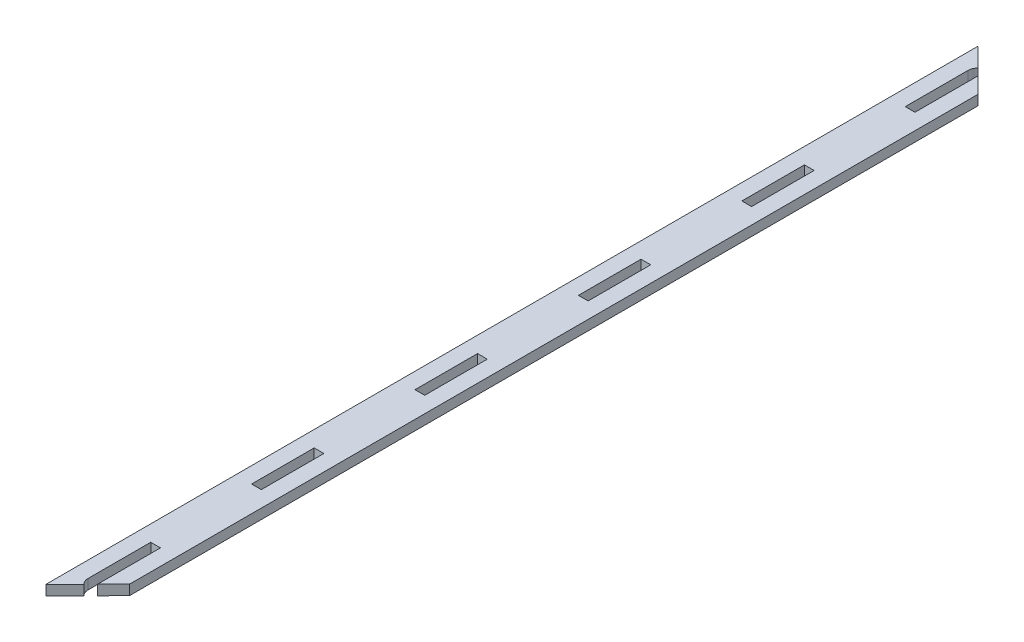
ISO-10303-21;
HEADER;
FILE_DESCRIPTION(('STEP AP214'),'2;1');
FILE_NAME('part.step','',(''),(''),'','','');
FILE_SCHEMA(('AUTOMOTIVE_DESIGN { 1 0 10303 214 1 1 1 1 }'));
ENDSEC;
DATA;
#1=APPLICATION_CONTEXT('core data for automotive mechanical design processes');
#2=APPLICATION_PROTOCOL_DEFINITION('international standard','automotive_design',2000,#1);
#3=PRODUCT_CONTEXT('',#1,'mechanical');
#4=PRODUCT('Part','Part','',(#3));
#5=PRODUCT_RELATED_PRODUCT_CATEGORY('part','',(#4));
#6=PRODUCT_DEFINITION_FORMATION('','',#4);
#7=PRODUCT_DEFINITION_CONTEXT('part definition',#1,'design');
#8=PRODUCT_DEFINITION('design','',#6,#7);
#9=PRODUCT_DEFINITION_SHAPE('','',#8);
#10=(LENGTH_UNIT() NAMED_UNIT(*) SI_UNIT(.MILLI.,.METRE.));
#11=(NAMED_UNIT(*) PLANE_ANGLE_UNIT() SI_UNIT($,.RADIAN.));
#12=(NAMED_UNIT(*) SI_UNIT($,.STERADIAN.) SOLID_ANGLE_UNIT());
#13=UNCERTAINTY_MEASURE_WITH_UNIT(LENGTH_MEASURE(1.E-05),#10,'distance_accuracy_value','');
#14=(GEOMETRIC_REPRESENTATION_CONTEXT(3) GLOBAL_UNCERTAINTY_ASSIGNED_CONTEXT((#13)) GLOBAL_UNIT_ASSIGNED_CONTEXT((#10,
#11,#12)) REPRESENTATION_CONTEXT('',''));
#15=CARTESIAN_POINT('',(0.,0.,0.));
#16=DIRECTION('',(0.,0.,1.));
#17=DIRECTION('',(1.,0.,0.));
#18=AXIS2_PLACEMENT_3D('',#15,#16,#17);
#19=CARTESIAN_POINT('',(5.04063999999979,-296.892534240329,-60.2456400000004));
#20=DIRECTION('',(0.,0.,1.));
#21=DIRECTION('',(1.,0.,0.));
#22=AXIS2_PLACEMENT_3D('',#19,#20,#21);
#23=PLANE('',#22);
#24=DIRECTION('',(0.,1.,0.));
#25=VECTOR('',#24,1.);
#26=CARTESIAN_POINT('',(8.13435999999979,-296.892534240329,-60.2456400000004));
#27=LINE('',#26,#25);
#28=CARTESIAN_POINT('',(8.13435999999979,0.,-60.2456400000004));
#29=VERTEX_POINT('',#28);
#30=CARTESIAN_POINT('',(8.13435999999979,3.175,-60.2456400000004));
#31=VERTEX_POINT('',#30);
#32=EDGE_CURVE('E112',#29,#31,#27,.T.);
#33=ORIENTED_EDGE('',*,*,#32,.F.);
#34=DIRECTION('',(-1.,0.,0.));
#35=VECTOR('',#34,1.);
#36=CARTESIAN_POINT('',(5.04063999999979,0.,-60.2456400000004));
#37=LINE('',#36,#35);
#38=CARTESIAN_POINT('',(5.04063999999979,0.,-60.2456400000004));
#39=VERTEX_POINT('',#38);
#40=EDGE_CURVE('E45',#29,#39,#37,.T.);
#41=ORIENTED_EDGE('',*,*,#40,.T.);
#42=DIRECTION('',(0.,1.,0.));
#43=VECTOR('',#42,1.);
#44=CARTESIAN_POINT('',(5.04063999999979,-296.892534240329,-60.2456400000004));
#45=LINE('',#44,#43);
#46=CARTESIAN_POINT('',(5.04063999999979,3.175,-60.2456400000004));
#47=VERTEX_POINT('',#46);
#48=EDGE_CURVE('E125',#39,#47,#45,.T.);
#49=ORIENTED_EDGE('',*,*,#48,.T.);
#50=DIRECTION('',(1.,0.,0.));
#51=VECTOR('',#50,1.);
#52=CARTESIAN_POINT('',(5.04063999999979,3.175,-60.2456400000004));
#53=LINE('',#52,#51);
#54=EDGE_CURVE('E122',#47,#31,#53,.T.);
#55=ORIENTED_EDGE('',*,*,#54,.T.);
#56=EDGE_LOOP('',(#33,#41,#49,#55));
#57=FACE_BOUND('',#56,.T.);
#58=ADVANCED_FACE('F41',(#57),#23,.F.);
#59=CARTESIAN_POINT('',(8.13435999999979,-296.892534240329,-60.2456400000004));
#60=DIRECTION('',(1.,0.,0.));
#61=DIRECTION('',(0.,0.,-1.));
#62=AXIS2_PLACEMENT_3D('',#59,#60,#61);
#63=PLANE('',#62);
#64=DIRECTION('',(0.,1.,0.));
#65=VECTOR('',#64,1.);
#66=CARTESIAN_POINT('',(8.13435999999973,-296.892534240329,-80.1643600000004));
#67=LINE('',#66,#65);
#68=CARTESIAN_POINT('',(8.13435999999973,0.,-80.1643600000004));
#69=VERTEX_POINT('',#68);
#70=CARTESIAN_POINT('',(8.13435999999973,3.175,-80.1643600000004));
#71=VERTEX_POINT('',#70);
#72=EDGE_CURVE('E115',#69,#71,#67,.T.);
#73=ORIENTED_EDGE('',*,*,#72,.F.);
#74=DIRECTION('',(0.,0.,1.));
#75=VECTOR('',#74,1.);
#76=CARTESIAN_POINT('',(8.13435999999979,0.,-60.2456400000004));
#77=LINE('',#76,#75);
#78=EDGE_CURVE('E93',#69,#29,#77,.T.);
#79=ORIENTED_EDGE('',*,*,#78,.T.);
#80=ORIENTED_EDGE('',*,*,#32,.T.);
#81=DIRECTION('',(0.,0.,-1.));
#82=VECTOR('',#81,1.);
#83=CARTESIAN_POINT('',(8.13435999999979,3.175,-60.2456400000004));
#84=LINE('',#83,#82);
#85=EDGE_CURVE('E503',#31,#71,#84,.T.);
#86=ORIENTED_EDGE('',*,*,#85,.T.);
#87=EDGE_LOOP('',(#73,#79,#80,#86));
#88=FACE_BOUND('',#87,.T.);
#89=ADVANCED_FACE('F109',(#88),#63,.F.);
#90=CARTESIAN_POINT('',(8.13435999999973,-296.892534240329,-80.1643600000004));
#91=DIRECTION('',(0.,0.,-1.));
#92=DIRECTION('',(-1.,0.,0.));
#93=AXIS2_PLACEMENT_3D('',#90,#91,#92);
#94=PLANE('',#93);
#95=DIRECTION('',(0.,1.,0.));
#96=VECTOR('',#95,1.);
#97=CARTESIAN_POINT('',(5.04063999999973,-296.892534240329,-80.1643600000004));
#98=LINE('',#97,#96);
#99=CARTESIAN_POINT('',(5.04063999999973,0.,-80.1643600000004));
#100=VERTEX_POINT('',#99);
#101=CARTESIAN_POINT('',(5.04063999999973,3.175,-80.1643600000004));
#102=VERTEX_POINT('',#101);
#103=EDGE_CURVE('E129',#100,#102,#98,.T.);
#104=ORIENTED_EDGE('',*,*,#103,.F.);
#105=DIRECTION('',(1.,0.,0.));
#106=VECTOR('',#105,1.);
#107=CARTESIAN_POINT('',(8.13435999999973,0.,-80.1643600000004));
#108=LINE('',#107,#106);
#109=EDGE_CURVE('E119',#100,#69,#108,.T.);
#110=ORIENTED_EDGE('',*,*,#109,.T.);
#111=ORIENTED_EDGE('',*,*,#72,.T.);
#112=DIRECTION('',(-1.,0.,0.));
#113=VECTOR('',#112,1.);
#114=CARTESIAN_POINT('',(8.13435999999973,3.175,-80.1643600000004));
#115=LINE('',#114,#113);
#116=EDGE_CURVE('E131',#71,#102,#115,.T.);
#117=ORIENTED_EDGE('',*,*,#116,.T.);
#118=EDGE_LOOP('',(#104,#110,#111,#117));
#119=FACE_BOUND('',#118,.T.);
#120=ADVANCED_FACE('F520',(#119),#94,.F.);
#121=CARTESIAN_POINT('',(5.04063999999973,-296.892534240329,-80.1643600000004));
#122=DIRECTION('',(-1.,0.,0.));
#123=DIRECTION('',(0.,0.,1.));
#124=AXIS2_PLACEMENT_3D('',#121,#122,#123);
#125=PLANE('',#124);
#126=ORIENTED_EDGE('',*,*,#48,.F.);
#127=DIRECTION('',(0.,0.,-1.));
#128=VECTOR('',#127,1.);
#129=CARTESIAN_POINT('',(5.04063999999973,0.,-80.1643600000004));
#130=LINE('',#129,#128);
#131=EDGE_CURVE('E99',#39,#100,#130,.T.);
#132=ORIENTED_EDGE('',*,*,#131,.T.);
#133=ORIENTED_EDGE('',*,*,#103,.T.);
#134=DIRECTION('',(0.,0.,1.));
#135=VECTOR('',#134,1.);
#136=CARTESIAN_POINT('',(5.04063999999973,3.175,-80.1643600000004));
#137=LINE('',#136,#135);
#138=EDGE_CURVE('E497',#102,#47,#137,.T.);
#139=ORIENTED_EDGE('',*,*,#138,.T.);
#140=EDGE_LOOP('',(#126,#132,#133,#139));
#141=FACE_BOUND('',#140,.T.);
#142=ADVANCED_FACE('F513',(#141),#125,.F.);
#143=CARTESIAN_POINT('',(0.,0.,0.));
#144=DIRECTION('',(0.,1.,0.));
#145=DIRECTION('',(0.,0.,1.));
#146=AXIS2_PLACEMENT_3D('',#143,#144,#145);
#147=PLANE('',#146);
#148=DIRECTION('',(0.707106781186543,0.,0.707106781186552));
#149=VECTOR('',#148,1.);
#150=CARTESIAN_POINT('',(5.98759591702659,0.,-290.469877722147));
#151=LINE('',#150,#149);
#152=CARTESIAN_POINT('',(-0.04064,0.,-296.498113639174));
#153=VERTEX_POINT('',#152);
#154=CARTESIAN_POINT('',(5.98759591702655,0.,-290.469877722147));
#155=VERTEX_POINT('',#154);
#156=EDGE_CURVE('E351',#153,#155,#151,.T.);
#157=ORIENTED_EDGE('',*,*,#156,.T.);
#158=CARTESIAN_POINT('',(8.175,0.,-288.224999999999));
#159=DIRECTION('',(0.,1.,0.));
#160=DIRECTION('',(0.,0.,1.));
#161=AXIS2_PLACEMENT_3D('',#158,#159,#160);
#162=CIRCLE('',#161,3.13436000000096);
#163=CARTESIAN_POINT('',(5.04063999999901,0.,-288.225));
#164=VERTEX_POINT('',#163);
#165=EDGE_CURVE('E492',#155,#164,#162,.T.);
#166=ORIENTED_EDGE('',*,*,#165,.T.);
#167=DIRECTION('',(0.,0.,1.));
#168=VECTOR('',#167,1.);
#169=CARTESIAN_POINT('',(5.04063999999908,0.,-268.26564));
#170=LINE('',#169,#168);
#171=CARTESIAN_POINT('',(5.04063999999908,0.,-268.26564));
#172=VERTEX_POINT('',#171);
#173=EDGE_CURVE('E489',#164,#172,#170,.T.);
#174=ORIENTED_EDGE('',*,*,#173,.T.);
#175=DIRECTION('',(1.,0.,0.));
#176=VECTOR('',#175,1.);
#177=CARTESIAN_POINT('',(8.13435999999908,0.,-268.26564));
#178=LINE('',#177,#176);
#179=CARTESIAN_POINT('',(8.13435999999908,0.,-268.26564));
#180=VERTEX_POINT('',#179);
#181=EDGE_CURVE('E486',#172,#180,#178,.T.);
#182=ORIENTED_EDGE('',*,*,#181,.T.);
#183=DIRECTION('',(0.,0.,-1.));
#184=VECTOR('',#183,1.);
#185=CARTESIAN_POINT('',(8.13436000000001,0.,-288.323113639174));
#186=LINE('',#185,#184);
#187=CARTESIAN_POINT('',(8.13436000000003,0.,-288.323113639174));
#188=VERTEX_POINT('',#187);
#189=EDGE_CURVE('E483',#180,#188,#186,.T.);
#190=ORIENTED_EDGE('',*,*,#189,.T.);
#191=DIRECTION('',(0.707106781186534,0.,0.707106781186562));
#192=VECTOR('',#191,1.);
#193=CARTESIAN_POINT('',(13.215639999999,0.,-283.241833639175));
#194=LINE('',#193,#192);
#195=CARTESIAN_POINT('',(13.215639999999,0.,-283.241833639175));
#196=VERTEX_POINT('',#195);
#197=EDGE_CURVE('E480',#188,#196,#194,.T.);
#198=ORIENTED_EDGE('',*,*,#197,.T.);
#199=DIRECTION('',(0.,0.,1.));
#200=VECTOR('',#199,1.);
#201=CARTESIAN_POINT('',(13.21564,0.,-13.1984932147829));
#202=LINE('',#201,#200);
#203=CARTESIAN_POINT('',(13.21564,0.,-13.1984932147829));
#204=VERTEX_POINT('',#203);
#205=EDGE_CURVE('E477',#196,#204,#202,.T.);
#206=ORIENTED_EDGE('',*,*,#205,.T.);
#207=DIRECTION('',(-0.706026406022671,0.,0.708185508181797));
#208=VECTOR('',#207,1.);
#209=CARTESIAN_POINT('',(8.13436,0.,-8.10167413221381));
#210=LINE('',#209,#208);
#211=CARTESIAN_POINT('',(8.13436,0.,-8.10167413221381));
#212=VERTEX_POINT('',#211);
#213=EDGE_CURVE('E474',#204,#212,#210,.T.);
#214=ORIENTED_EDGE('',*,*,#213,.T.);
#215=DIRECTION('',(0.,0.,-1.));
#216=VECTOR('',#215,1.);
#217=CARTESIAN_POINT('',(8.13436,0.,-28.1593600000005));
#218=LINE('',#217,#216);
#219=CARTESIAN_POINT('',(8.13436,0.,-28.1593600000005));
#220=VERTEX_POINT('',#219);
#221=EDGE_CURVE('E471',#212,#220,#218,.T.);
#222=ORIENTED_EDGE('',*,*,#221,.T.);
#223=DIRECTION('',(-1.,0.,0.));
#224=VECTOR('',#223,1.);
#225=CARTESIAN_POINT('',(5.0406399999999,0.,-28.1593600000005));
#226=LINE('',#225,#224);
#227=CARTESIAN_POINT('',(5.0406399999999,0.,-28.1593600000005));
#228=VERTEX_POINT('',#227);
#229=EDGE_CURVE('E468',#220,#228,#226,.T.);
#230=ORIENTED_EDGE('',*,*,#229,.T.);
#231=DIRECTION('',(0.,0.,1.));
#232=VECTOR('',#231,1.);
#233=CARTESIAN_POINT('',(5.04064,0.,-8.20000000000051));
#234=LINE('',#233,#232);
#235=CARTESIAN_POINT('',(5.04064,0.,-8.20000000000051));
#236=VERTEX_POINT('',#235);
#237=EDGE_CURVE('E465',#228,#236,#234,.T.);
#238=ORIENTED_EDGE('',*,*,#237,.T.);
#239=CARTESIAN_POINT('',(8.175,0.,-8.20000000000052));
#240=DIRECTION('',(0.,1.,0.));
#241=DIRECTION('',(0.,0.,1.));
#242=AXIS2_PLACEMENT_3D('',#239,#240,#241);
#243=CIRCLE('',#242,3.13436);
#244=CARTESIAN_POINT('',(5.99102575653439,0.,-5.95178534977719));
#245=VERTEX_POINT('',#244);
#246=EDGE_CURVE('E462',#236,#245,#243,.T.);
#247=ORIENTED_EDGE('',*,*,#246,.T.);
#248=DIRECTION('',(-0.706026406022668,0.,0.7081855081818));
#249=VECTOR('',#248,1.);
#250=CARTESIAN_POINT('',(-0.04064,0.,0.0983258677867064));
#251=LINE('',#250,#249);
#252=CARTESIAN_POINT('',(-0.04064,0.,0.0983258677867064));
#253=VERTEX_POINT('',#252);
#254=EDGE_CURVE('E459',#245,#253,#251,.T.);
#255=ORIENTED_EDGE('',*,*,#254,.T.);
#256=DIRECTION('',(0.,0.,-1.));
#257=VECTOR('',#256,1.);
#258=CARTESIAN_POINT('',(-0.04064,0.,-296.498113639174));
#259=LINE('',#258,#257);
#260=EDGE_CURVE('E11',#253,#153,#259,.T.);
#261=ORIENTED_EDGE('',*,*,#260,.T.);
#262=EDGE_LOOP('',(#157,#166,#174,#182,#190,#198,#206,#214,#222,#230,#238,#247,#255,#261));
#263=FACE_BOUND('',#262,.T.);
#264=DIRECTION('',(0.,0.,1.));
#265=VECTOR('',#264,1.);
#266=CARTESIAN_POINT('',(8.13435999999926,0.,-216.26064));
#267=LINE('',#266,#265);
#268=CARTESIAN_POINT('',(8.13435999999919,0.,-236.17936));
#269=VERTEX_POINT('',#268);
#270=CARTESIAN_POINT('',(8.13435999999926,0.,-216.26064));
#271=VERTEX_POINT('',#270);
#272=EDGE_CURVE('E61',#269,#271,#267,.T.);
#273=ORIENTED_EDGE('',*,*,#272,.F.);
#274=DIRECTION('',(1.,0.,0.));
#275=VECTOR('',#274,1.);
#276=CARTESIAN_POINT('',(8.13435999999919,0.,-236.17936));
#277=LINE('',#276,#275);
#278=CARTESIAN_POINT('',(5.04063999999919,0.,-236.17936));
#279=VERTEX_POINT('',#278);
#280=EDGE_CURVE('E52',#279,#269,#277,.T.);
#281=ORIENTED_EDGE('',*,*,#280,.F.);
#282=DIRECTION('',(0.,0.,-1.));
#283=VECTOR('',#282,1.);
#284=CARTESIAN_POINT('',(5.04063999999919,0.,-236.17936));
#285=LINE('',#284,#283);
#286=CARTESIAN_POINT('',(5.04063999999926,0.,-216.26064));
#287=VERTEX_POINT('',#286);
#288=EDGE_CURVE('E435',#287,#279,#285,.T.);
#289=ORIENTED_EDGE('',*,*,#288,.F.);
#290=DIRECTION('',(-1.,0.,0.));
#291=VECTOR('',#290,1.);
#292=CARTESIAN_POINT('',(5.04063999999926,0.,-216.26064));
#293=LINE('',#292,#291);
#294=EDGE_CURVE('E439',#271,#287,#293,.T.);
#295=ORIENTED_EDGE('',*,*,#294,.F.);
#296=EDGE_LOOP('',(#273,#281,#289,#295));
#297=FACE_BOUND('',#296,.T.);
#298=DIRECTION('',(-1.,0.,0.));
#299=VECTOR('',#298,1.);
#300=CARTESIAN_POINT('',(5.04063999999944,0.,-164.25564));
#301=LINE('',#300,#299);
#302=CARTESIAN_POINT('',(8.13435999999944,0.,-164.25564));
#303=VERTEX_POINT('',#302);
#304=CARTESIAN_POINT('',(5.04063999999944,0.,-164.25564));
#305=VERTEX_POINT('',#304);
#306=EDGE_CURVE('E895',#303,#305,#301,.T.);
#307=ORIENTED_EDGE('',*,*,#306,.F.);
#308=DIRECTION('',(0.,0.,1.));
#309=VECTOR('',#308,1.);
#310=CARTESIAN_POINT('',(8.13435999999944,0.,-164.25564));
#311=LINE('',#310,#309);
#312=CARTESIAN_POINT('',(8.13435999999937,0.,-184.17436));
#313=VERTEX_POINT('',#312);
#314=EDGE_CURVE('E451',#313,#303,#311,.T.);
#315=ORIENTED_EDGE('',*,*,#314,.F.);
#316=DIRECTION('',(1.,0.,0.));
#317=VECTOR('',#316,1.);
#318=CARTESIAN_POINT('',(8.13435999999937,0.,-184.17436));
#319=LINE('',#318,#317);
#320=CARTESIAN_POINT('',(5.04063999999937,0.,-184.17436));
#321=VERTEX_POINT('',#320);
#322=EDGE_CURVE('E455',#321,#313,#319,.T.);
#323=ORIENTED_EDGE('',*,*,#322,.F.);
#324=DIRECTION('',(0.,0.,-1.));
#325=VECTOR('',#324,1.);
#326=CARTESIAN_POINT('',(5.04063999999937,0.,-184.17436));
#327=LINE('',#326,#325);
#328=EDGE_CURVE('E896',#305,#321,#327,.T.);
#329=ORIENTED_EDGE('',*,*,#328,.F.);
#330=EDGE_LOOP('',(#307,#315,#323,#329));
#331=FACE_BOUND('',#330,.T.);
#332=DIRECTION('',(-1.,0.,0.));
#333=VECTOR('',#332,1.);
#334=CARTESIAN_POINT('',(5.04063999999962,0.,-112.25064));
#335=LINE('',#334,#333);
#336=CARTESIAN_POINT('',(8.13435999999962,0.,-112.25064));
#337=VERTEX_POINT('',#336);
#338=CARTESIAN_POINT('',(5.04063999999962,0.,-112.25064));
#339=VERTEX_POINT('',#338);
#340=EDGE_CURVE('E105',#337,#339,#335,.T.);
#341=ORIENTED_EDGE('',*,*,#340,.F.);
#342=DIRECTION('',(0.,0.,1.));
#343=VECTOR('',#342,1.);
#344=CARTESIAN_POINT('',(8.13435999999962,0.,-112.25064));
#345=LINE('',#344,#343);
#346=CARTESIAN_POINT('',(8.13435999999955,0.,-132.16936));
#347=VERTEX_POINT('',#346);
#348=EDGE_CURVE('E900',#347,#337,#345,.T.);
#349=ORIENTED_EDGE('',*,*,#348,.F.);
#350=DIRECTION('',(1.,0.,0.));
#351=VECTOR('',#350,1.);
#352=CARTESIAN_POINT('',(8.13435999999955,0.,-132.16936));
#353=LINE('',#352,#351);
#354=CARTESIAN_POINT('',(5.04063999999955,0.,-132.16936));
#355=VERTEX_POINT('',#354);
#356=EDGE_CURVE('E910',#355,#347,#353,.T.);
#357=ORIENTED_EDGE('',*,*,#356,.F.);
#358=DIRECTION('',(0.,0.,-1.));
#359=VECTOR('',#358,1.);
#360=CARTESIAN_POINT('',(5.04063999999955,0.,-132.16936));
#361=LINE('',#360,#359);
#362=EDGE_CURVE('E118',#339,#355,#361,.T.);
#363=ORIENTED_EDGE('',*,*,#362,.F.);
#364=EDGE_LOOP('',(#341,#349,#357,#363));
#365=FACE_BOUND('',#364,.T.);
#366=ORIENTED_EDGE('',*,*,#40,.F.);
#367=ORIENTED_EDGE('',*,*,#78,.F.);
#368=ORIENTED_EDGE('',*,*,#109,.F.);
#369=ORIENTED_EDGE('',*,*,#131,.F.);
#370=EDGE_LOOP('',(#366,#367,#368,#369));
#371=FACE_BOUND('',#370,.T.);
#372=ADVANCED_FACE('F43',(#263,#297,#331,#365,#371),#147,.F.);
#373=CARTESIAN_POINT('',(-0.04064,-296.892534240329,-296.498113639174));
#374=DIRECTION('',(-1.,0.,0.));
#375=DIRECTION('',(0.,0.,1.));
#376=AXIS2_PLACEMENT_3D('',#373,#374,#375);
#377=PLANE('',#376);
#378=ORIENTED_EDGE('',*,*,#260,.F.);
#379=DIRECTION('',(0.,1.,0.));
#380=VECTOR('',#379,1.);
#381=CARTESIAN_POINT('',(-0.04064,-296.892534240329,0.0983258677867064));
#382=LINE('',#381,#380);
#383=CARTESIAN_POINT('',(-0.04064,3.175,0.0983258677867064));
#384=VERTEX_POINT('',#383);
#385=EDGE_CURVE('E335',#253,#384,#382,.T.);
#386=ORIENTED_EDGE('',*,*,#385,.T.);
#387=DIRECTION('',(0.,0.,1.));
#388=VECTOR('',#387,1.);
#389=CARTESIAN_POINT('',(-0.04064,3.175,-296.498113639174));
#390=LINE('',#389,#388);
#391=CARTESIAN_POINT('',(-0.04064,3.175,-296.498113639174));
#392=VERTEX_POINT('',#391);
#393=EDGE_CURVE('E235',#392,#384,#390,.T.);
#394=ORIENTED_EDGE('',*,*,#393,.F.);
#395=DIRECTION('',(0.,1.,0.));
#396=VECTOR('',#395,1.);
#397=CARTESIAN_POINT('',(-0.04064,-296.892534240329,-296.498113639174));
#398=LINE('',#397,#396);
#399=EDGE_CURVE('E287',#153,#392,#398,.T.);
#400=ORIENTED_EDGE('',*,*,#399,.F.);
#401=EDGE_LOOP('',(#378,#386,#394,#400));
#402=FACE_BOUND('',#401,.T.);
#403=ADVANCED_FACE('F357',(#402),#377,.T.);
#404=CARTESIAN_POINT('',(-0.04064,-296.892534240329,0.0983258677867064));
#405=DIRECTION('',(0.7081855081818,0.,0.706026406022668));
#406=DIRECTION('',(0.706026406022668,0.,-0.7081855081818));
#407=AXIS2_PLACEMENT_3D('',#404,#405,#406);
#408=PLANE('',#407);
#409=ORIENTED_EDGE('',*,*,#254,.F.);
#410=DIRECTION('',(0.,1.,0.));
#411=VECTOR('',#410,1.);
#412=CARTESIAN_POINT('',(5.99102575653439,-296.892534240329,-5.95178534977719));
#413=LINE('',#412,#411);
#414=CARTESIAN_POINT('',(5.99102575653439,3.175,-5.95178534977719));
#415=VERTEX_POINT('',#414);
#416=EDGE_CURVE('E331',#245,#415,#413,.T.);
#417=ORIENTED_EDGE('',*,*,#416,.T.);
#418=DIRECTION('',(0.706026406022668,0.,-0.7081855081818));
#419=VECTOR('',#418,1.);
#420=CARTESIAN_POINT('',(-0.04064,3.175,0.0983258677867064));
#421=LINE('',#420,#419);
#422=EDGE_CURVE('E239',#384,#415,#421,.T.);
#423=ORIENTED_EDGE('',*,*,#422,.F.);
#424=ORIENTED_EDGE('',*,*,#385,.F.);
#425=EDGE_LOOP('',(#409,#417,#423,#424));
#426=FACE_BOUND('',#425,.T.);
#427=ADVANCED_FACE('F606',(#426),#408,.T.);
#428=CARTESIAN_POINT('',(8.175,-296.892534240329,-8.20000000000052));
#429=DIRECTION('',(0.,1.,0.));
#430=DIRECTION('',(0.,0.,1.));
#431=AXIS2_PLACEMENT_3D('',#428,#429,#430);
#432=CYLINDRICAL_SURFACE('',#431,3.13436);
#433=ORIENTED_EDGE('',*,*,#246,.F.);
#434=DIRECTION('',(0.,1.,0.));
#435=VECTOR('',#434,1.);
#436=CARTESIAN_POINT('',(5.04064,-296.892534240329,-8.20000000000051));
#437=LINE('',#436,#435);
#438=CARTESIAN_POINT('',(5.04064,3.175,-8.20000000000051));
#439=VERTEX_POINT('',#438);
#440=EDGE_CURVE('E327',#236,#439,#437,.T.);
#441=ORIENTED_EDGE('',*,*,#440,.T.);
#442=CARTESIAN_POINT('',(8.175,3.175,-8.20000000000052));
#443=DIRECTION('',(0.,-1.,0.));
#444=DIRECTION('',(0.,0.,1.));
#445=AXIS2_PLACEMENT_3D('',#442,#443,#444);
#446=CIRCLE('',#445,3.13436);
#447=EDGE_CURVE('E243',#415,#439,#446,.T.);
#448=ORIENTED_EDGE('',*,*,#447,.F.);
#449=ORIENTED_EDGE('',*,*,#416,.F.);
#450=EDGE_LOOP('',(#433,#441,#448,#449));
#451=FACE_BOUND('',#450,.T.);
#452=ADVANCED_FACE('F602',(#451),#432,.F.);
#453=CARTESIAN_POINT('',(5.04064,-296.892534240329,-8.20000000000051));
#454=DIRECTION('',(1.,0.,0.));
#455=DIRECTION('',(0.,0.,-1.));
#456=AXIS2_PLACEMENT_3D('',#453,#454,#455);
#457=PLANE('',#456);
#458=ORIENTED_EDGE('',*,*,#237,.F.);
#459=DIRECTION('',(0.,1.,0.));
#460=VECTOR('',#459,1.);
#461=CARTESIAN_POINT('',(5.0406399999999,-296.892534240329,-28.1593600000005));
#462=LINE('',#461,#460);
#463=CARTESIAN_POINT('',(5.0406399999999,3.175,-28.1593600000005));
#464=VERTEX_POINT('',#463);
#465=EDGE_CURVE('E323',#228,#464,#462,.T.);
#466=ORIENTED_EDGE('',*,*,#465,.T.);
#467=DIRECTION('',(0.,0.,-1.));
#468=VECTOR('',#467,1.);
#469=CARTESIAN_POINT('',(5.04064,3.175,-8.20000000000051));
#470=LINE('',#469,#468);
#471=EDGE_CURVE('E247',#439,#464,#470,.T.);
#472=ORIENTED_EDGE('',*,*,#471,.F.);
#473=ORIENTED_EDGE('',*,*,#440,.F.);
#474=EDGE_LOOP('',(#458,#466,#472,#473));
#475=FACE_BOUND('',#474,.T.);
#476=ADVANCED_FACE('F598',(#475),#457,.T.);
#477=CARTESIAN_POINT('',(5.0406399999999,-296.892534240329,-28.1593600000005));
#478=DIRECTION('',(0.,0.,1.));
#479=DIRECTION('',(1.,0.,0.));
#480=AXIS2_PLACEMENT_3D('',#477,#478,#479);
#481=PLANE('',#480);
#482=ORIENTED_EDGE('',*,*,#229,.F.);
#483=DIRECTION('',(0.,1.,0.));
#484=VECTOR('',#483,1.);
#485=CARTESIAN_POINT('',(8.13436,-296.892534240329,-28.1593600000005));
#486=LINE('',#485,#484);
#487=CARTESIAN_POINT('',(8.13436,3.175,-28.1593600000005));
#488=VERTEX_POINT('',#487);
#489=EDGE_CURVE('E319',#220,#488,#486,.T.);
#490=ORIENTED_EDGE('',*,*,#489,.T.);
#491=DIRECTION('',(1.,0.,0.));
#492=VECTOR('',#491,1.);
#493=CARTESIAN_POINT('',(5.0406399999999,3.175,-28.1593600000005));
#494=LINE('',#493,#492);
#495=EDGE_CURVE('E251',#464,#488,#494,.T.);
#496=ORIENTED_EDGE('',*,*,#495,.F.);
#497=ORIENTED_EDGE('',*,*,#465,.F.);
#498=EDGE_LOOP('',(#482,#490,#496,#497));
#499=FACE_BOUND('',#498,.T.);
#500=ADVANCED_FACE('F592',(#499),#481,.T.);
#501=CARTESIAN_POINT('',(8.13436,-296.892534240329,-28.1593600000005));
#502=DIRECTION('',(-1.,0.,0.));
#503=DIRECTION('',(0.,0.,1.));
#504=AXIS2_PLACEMENT_3D('',#501,#502,#503);
#505=PLANE('',#504);
#506=ORIENTED_EDGE('',*,*,#221,.F.);
#507=DIRECTION('',(0.,1.,0.));
#508=VECTOR('',#507,1.);
#509=CARTESIAN_POINT('',(8.13436,-296.892534240329,-8.10167413221381));
#510=LINE('',#509,#508);
#511=CARTESIAN_POINT('',(8.13436,3.175,-8.10167413221381));
#512=VERTEX_POINT('',#511);
#513=EDGE_CURVE('E315',#212,#512,#510,.T.);
#514=ORIENTED_EDGE('',*,*,#513,.T.);
#515=DIRECTION('',(0.,0.,1.));
#516=VECTOR('',#515,1.);
#517=CARTESIAN_POINT('',(8.13436,3.175,-28.1593600000005));
#518=LINE('',#517,#516);
#519=EDGE_CURVE('E255',#488,#512,#518,.T.);
#520=ORIENTED_EDGE('',*,*,#519,.F.);
#521=ORIENTED_EDGE('',*,*,#489,.F.);
#522=EDGE_LOOP('',(#506,#514,#520,#521));
#523=FACE_BOUND('',#522,.T.);
#524=ADVANCED_FACE('F588',(#523),#505,.T.);
#525=CARTESIAN_POINT('',(8.13436,-296.892534240329,-8.10167413221381));
#526=DIRECTION('',(0.708185508181797,0.,0.706026406022671));
#527=DIRECTION('',(0.706026406022671,0.,-0.708185508181797));
#528=AXIS2_PLACEMENT_3D('',#525,#526,#527);
#529=PLANE('',#528);
#530=ORIENTED_EDGE('',*,*,#213,.F.);
#531=DIRECTION('',(0.,1.,0.));
#532=VECTOR('',#531,1.);
#533=CARTESIAN_POINT('',(13.21564,-296.892534240329,-13.1984932147829));
#534=LINE('',#533,#532);
#535=CARTESIAN_POINT('',(13.21564,3.175,-13.1984932147829));
#536=VERTEX_POINT('',#535);
#537=EDGE_CURVE('E311',#204,#536,#534,.T.);
#538=ORIENTED_EDGE('',*,*,#537,.T.);
#539=DIRECTION('',(0.706026406022671,0.,-0.708185508181797));
#540=VECTOR('',#539,1.);
#541=CARTESIAN_POINT('',(8.13436,3.175,-8.10167413221381));
#542=LINE('',#541,#540);
#543=EDGE_CURVE('E259',#512,#536,#542,.T.);
#544=ORIENTED_EDGE('',*,*,#543,.F.);
#545=ORIENTED_EDGE('',*,*,#513,.F.);
#546=EDGE_LOOP('',(#530,#538,#544,#545));
#547=FACE_BOUND('',#546,.T.);
#548=ADVANCED_FACE('F582',(#547),#529,.T.);
#549=CARTESIAN_POINT('',(13.21564,-296.892534240329,-13.1984932147829));
#550=DIRECTION('',(1.,0.,0.));
#551=DIRECTION('',(0.,0.,-1.));
#552=AXIS2_PLACEMENT_3D('',#549,#550,#551);
#553=PLANE('',#552);
#554=ORIENTED_EDGE('',*,*,#205,.F.);
#555=DIRECTION('',(0.,1.,0.));
#556=VECTOR('',#555,1.);
#557=CARTESIAN_POINT('',(13.215639999999,-296.892534240329,-283.241833639175));
#558=LINE('',#557,#556);
#559=CARTESIAN_POINT('',(13.215639999999,3.175,-283.241833639175));
#560=VERTEX_POINT('',#559);
#561=EDGE_CURVE('E307',#196,#560,#558,.T.);
#562=ORIENTED_EDGE('',*,*,#561,.T.);
#563=DIRECTION('',(0.,0.,-1.));
#564=VECTOR('',#563,1.);
#565=CARTESIAN_POINT('',(13.21564,3.175,-13.1984932147829));
#566=LINE('',#565,#564);
#567=EDGE_CURVE('E263',#536,#560,#566,.T.);
#568=ORIENTED_EDGE('',*,*,#567,.F.);
#569=ORIENTED_EDGE('',*,*,#537,.F.);
#570=EDGE_LOOP('',(#554,#562,#568,#569));
#571=FACE_BOUND('',#570,.T.);
#572=ADVANCED_FACE('F579',(#571),#553,.T.);
#573=CARTESIAN_POINT('',(13.215639999999,-296.892534240329,-283.241833639175));
#574=DIRECTION('',(0.707106781186562,0.,-0.707106781186534));
#575=DIRECTION('',(-0.707106781186534,0.,-0.707106781186562));
#576=AXIS2_PLACEMENT_3D('',#573,#574,#575);
#577=PLANE('',#576);
#578=ORIENTED_EDGE('',*,*,#197,.F.);
#579=DIRECTION('',(0.,1.,0.));
#580=VECTOR('',#579,1.);
#581=CARTESIAN_POINT('',(8.13436000000001,-296.892534240329,-288.323113639174));
#582=LINE('',#581,#580);
#583=CARTESIAN_POINT('',(8.13436000000001,3.175,-288.323113639174));
#584=VERTEX_POINT('',#583);
#585=EDGE_CURVE('E303',#188,#584,#582,.T.);
#586=ORIENTED_EDGE('',*,*,#585,.T.);
#587=DIRECTION('',(-0.707106781186534,0.,-0.707106781186562));
#588=VECTOR('',#587,1.);
#589=CARTESIAN_POINT('',(13.215639999999,3.175,-283.241833639175));
#590=LINE('',#589,#588);
#591=EDGE_CURVE('E267',#560,#584,#590,.T.);
#592=ORIENTED_EDGE('',*,*,#591,.F.);
#593=ORIENTED_EDGE('',*,*,#561,.F.);
#594=EDGE_LOOP('',(#578,#586,#592,#593));
#595=FACE_BOUND('',#594,.T.);
#596=ADVANCED_FACE('F573',(#595),#577,.T.);
#597=CARTESIAN_POINT('',(8.13436000000001,-296.892534240329,-288.323113639174));
#598=DIRECTION('',(-1.,0.,0.));
#599=DIRECTION('',(0.,0.,1.));
#600=AXIS2_PLACEMENT_3D('',#597,#598,#599);
#601=PLANE('',#600);
#602=ORIENTED_EDGE('',*,*,#189,.F.);
#603=DIRECTION('',(0.,1.,0.));
#604=VECTOR('',#603,1.);
#605=CARTESIAN_POINT('',(8.13435999999908,-296.892534240329,-268.26564));
#606=LINE('',#605,#604);
#607=CARTESIAN_POINT('',(8.13435999999908,3.175,-268.26564));
#608=VERTEX_POINT('',#607);
#609=EDGE_CURVE('E299',#180,#608,#606,.T.);
#610=ORIENTED_EDGE('',*,*,#609,.T.);
#611=DIRECTION('',(0.,0.,1.));
#612=VECTOR('',#611,1.);
#613=CARTESIAN_POINT('',(8.13436000000001,3.175,-288.323113639174));
#614=LINE('',#613,#612);
#615=EDGE_CURVE('E271',#584,#608,#614,.T.);
#616=ORIENTED_EDGE('',*,*,#615,.F.);
#617=ORIENTED_EDGE('',*,*,#585,.F.);
#618=EDGE_LOOP('',(#602,#610,#616,#617));
#619=FACE_BOUND('',#618,.T.);
#620=ADVANCED_FACE('F562',(#619),#601,.T.);
#621=CARTESIAN_POINT('',(8.13435999999908,-296.892534240329,-268.26564));
#622=DIRECTION('',(0.,0.,-1.));
#623=DIRECTION('',(-1.,0.,0.));
#624=AXIS2_PLACEMENT_3D('',#621,#622,#623);
#625=PLANE('',#624);
#626=ORIENTED_EDGE('',*,*,#181,.F.);
#627=DIRECTION('',(0.,1.,0.));
#628=VECTOR('',#627,1.);
#629=CARTESIAN_POINT('',(5.04063999999908,-296.892534240329,-268.26564));
#630=LINE('',#629,#628);
#631=CARTESIAN_POINT('',(5.04063999999908,3.175,-268.26564));
#632=VERTEX_POINT('',#631);
#633=EDGE_CURVE('E295',#172,#632,#630,.T.);
#634=ORIENTED_EDGE('',*,*,#633,.T.);
#635=DIRECTION('',(-1.,0.,0.));
#636=VECTOR('',#635,1.);
#637=CARTESIAN_POINT('',(8.13435999999908,3.175,-268.26564));
#638=LINE('',#637,#636);
#639=EDGE_CURVE('E275',#608,#632,#638,.T.);
#640=ORIENTED_EDGE('',*,*,#639,.F.);
#641=ORIENTED_EDGE('',*,*,#609,.F.);
#642=EDGE_LOOP('',(#626,#634,#640,#641));
#643=FACE_BOUND('',#642,.T.);
#644=ADVANCED_FACE('F566',(#643),#625,.T.);
#645=CARTESIAN_POINT('',(5.04063999999908,-296.892534240329,-268.26564));
#646=DIRECTION('',(1.,0.,0.));
#647=DIRECTION('',(0.,0.,-1.));
#648=AXIS2_PLACEMENT_3D('',#645,#646,#647);
#649=PLANE('',#648);
#650=ORIENTED_EDGE('',*,*,#173,.F.);
#651=DIRECTION('',(0.,1.,0.));
#652=VECTOR('',#651,1.);
#653=CARTESIAN_POINT('',(5.04063999999901,-296.892534240329,-288.225));
#654=LINE('',#653,#652);
#655=CARTESIAN_POINT('',(5.04063999999901,3.175,-288.225));
#656=VERTEX_POINT('',#655);
#657=EDGE_CURVE('E291',#164,#656,#654,.T.);
#658=ORIENTED_EDGE('',*,*,#657,.T.);
#659=DIRECTION('',(0.,0.,-1.));
#660=VECTOR('',#659,1.);
#661=CARTESIAN_POINT('',(5.04063999999908,3.175,-268.26564));
#662=LINE('',#661,#660);
#663=EDGE_CURVE('E279',#632,#656,#662,.T.);
#664=ORIENTED_EDGE('',*,*,#663,.F.);
#665=ORIENTED_EDGE('',*,*,#633,.F.);
#666=EDGE_LOOP('',(#650,#658,#664,#665));
#667=FACE_BOUND('',#666,.T.);
#668=ADVANCED_FACE('F607',(#667),#649,.T.);
#669=CARTESIAN_POINT('',(8.175,-296.892534240329,-288.224999999999));
#670=DIRECTION('',(0.,1.,0.));
#671=DIRECTION('',(0.,0.,1.));
#672=AXIS2_PLACEMENT_3D('',#669,#670,#671);
#673=CYLINDRICAL_SURFACE('',#672,3.13436000000096);
#674=ORIENTED_EDGE('',*,*,#165,.F.);
#675=DIRECTION('',(0.,1.,0.));
#676=VECTOR('',#675,1.);
#677=CARTESIAN_POINT('',(5.98759591702656,-296.892534240329,-290.469877722147));
#678=LINE('',#677,#676);
#679=CARTESIAN_POINT('',(5.98759591702656,3.175,-290.469877722147));
#680=VERTEX_POINT('',#679);
#681=EDGE_CURVE('E106',#155,#680,#678,.T.);
#682=ORIENTED_EDGE('',*,*,#681,.T.);
#683=CARTESIAN_POINT('',(8.175,3.175,-288.224999999999));
#684=DIRECTION('',(0.,-1.,0.));
#685=DIRECTION('',(0.,0.,1.));
#686=AXIS2_PLACEMENT_3D('',#683,#684,#685);
#687=CIRCLE('',#686,3.13436000000096);
#688=EDGE_CURVE('E283',#656,#680,#687,.T.);
#689=ORIENTED_EDGE('',*,*,#688,.F.);
#690=ORIENTED_EDGE('',*,*,#657,.F.);
#691=EDGE_LOOP('',(#674,#682,#689,#690));
#692=FACE_BOUND('',#691,.T.);
#693=ADVANCED_FACE('F371',(#692),#673,.F.);
#694=CARTESIAN_POINT('',(5.98759591702659,-296.892534240329,-290.469877722147));
#695=DIRECTION('',(0.707106781186552,0.,-0.707106781186543));
#696=DIRECTION('',(-0.707106781186543,0.,-0.707106781186552));
#697=AXIS2_PLACEMENT_3D('',#694,#695,#696);
#698=PLANE('',#697);
#699=ORIENTED_EDGE('',*,*,#156,.F.);
#700=ORIENTED_EDGE('',*,*,#399,.T.);
#701=DIRECTION('',(-0.707106781186543,0.,-0.707106781186552));
#702=VECTOR('',#701,1.);
#703=CARTESIAN_POINT('',(5.98759591702659,3.175,-290.469877722147));
#704=LINE('',#703,#702);
#705=EDGE_CURVE('E220',#680,#392,#704,.T.);
#706=ORIENTED_EDGE('',*,*,#705,.F.);
#707=ORIENTED_EDGE('',*,*,#681,.F.);
#708=EDGE_LOOP('',(#699,#700,#706,#707));
#709=FACE_BOUND('',#708,.T.);
#710=ADVANCED_FACE('F346',(#709),#698,.T.);
#711=CARTESIAN_POINT('',(0.,3.175,0.));
#712=DIRECTION('',(0.,1.,0.));
#713=DIRECTION('',(0.,0.,1.));
#714=AXIS2_PLACEMENT_3D('',#711,#712,#713);
#715=PLANE('',#714);
#716=ORIENTED_EDGE('',*,*,#705,.T.);
#717=ORIENTED_EDGE('',*,*,#393,.T.);
#718=ORIENTED_EDGE('',*,*,#422,.T.);
#719=ORIENTED_EDGE('',*,*,#447,.T.);
#720=ORIENTED_EDGE('',*,*,#471,.T.);
#721=ORIENTED_EDGE('',*,*,#495,.T.);
#722=ORIENTED_EDGE('',*,*,#519,.T.);
#723=ORIENTED_EDGE('',*,*,#543,.T.);
#724=ORIENTED_EDGE('',*,*,#567,.T.);
#725=ORIENTED_EDGE('',*,*,#591,.T.);
#726=ORIENTED_EDGE('',*,*,#615,.T.);
#727=ORIENTED_EDGE('',*,*,#639,.T.);
#728=ORIENTED_EDGE('',*,*,#663,.T.);
#729=ORIENTED_EDGE('',*,*,#688,.T.);
#730=EDGE_LOOP('',(#716,#717,#718,#719,#720,#721,#722,#723,#724,#725,#726,#727,#728,#729));
#731=FACE_BOUND('',#730,.T.);
#732=DIRECTION('',(1.,0.,0.));
#733=VECTOR('',#732,1.);
#734=CARTESIAN_POINT('',(5.04063999999926,3.175,-216.26064));
#735=LINE('',#734,#733);
#736=CARTESIAN_POINT('',(5.04063999999926,3.175,-216.26064));
#737=VERTEX_POINT('',#736);
#738=CARTESIAN_POINT('',(8.13435999999926,3.175,-216.26064));
#739=VERTEX_POINT('',#738);
#740=EDGE_CURVE('E188',#737,#739,#735,.T.);
#741=ORIENTED_EDGE('',*,*,#740,.F.);
#742=DIRECTION('',(0.,0.,1.));
#743=VECTOR('',#742,1.);
#744=CARTESIAN_POINT('',(5.04063999999919,3.175,-236.17936));
#745=LINE('',#744,#743);
#746=CARTESIAN_POINT('',(5.04063999999919,3.175,-236.17936));
#747=VERTEX_POINT('',#746);
#748=EDGE_CURVE('E211',#747,#737,#745,.T.);
#749=ORIENTED_EDGE('',*,*,#748,.F.);
#750=DIRECTION('',(-1.,0.,0.));
#751=VECTOR('',#750,1.);
#752=CARTESIAN_POINT('',(8.13435999999919,3.175,-236.17936));
#753=LINE('',#752,#751);
#754=CARTESIAN_POINT('',(8.13435999999919,3.175,-236.17936));
#755=VERTEX_POINT('',#754);
#756=EDGE_CURVE('E207',#755,#747,#753,.T.);
#757=ORIENTED_EDGE('',*,*,#756,.F.);
#758=DIRECTION('',(0.,0.,-1.));
#759=VECTOR('',#758,1.);
#760=CARTESIAN_POINT('',(8.13435999999926,3.175,-216.26064));
#761=LINE('',#760,#759);
#762=EDGE_CURVE('E203',#739,#755,#761,.T.);
#763=ORIENTED_EDGE('',*,*,#762,.F.);
#764=EDGE_LOOP('',(#741,#749,#757,#763));
#765=FACE_BOUND('',#764,.T.);
#766=DIRECTION('',(0.,0.,1.));
#767=VECTOR('',#766,1.);
#768=CARTESIAN_POINT('',(5.04063999999937,3.175,-184.17436));
#769=LINE('',#768,#767);
#770=CARTESIAN_POINT('',(5.04063999999937,3.175,-184.17436));
#771=VERTEX_POINT('',#770);
#772=CARTESIAN_POINT('',(5.04063999999944,3.175,-164.25564));
#773=VERTEX_POINT('',#772);
#774=EDGE_CURVE('E156',#771,#773,#769,.T.);
#775=ORIENTED_EDGE('',*,*,#774,.F.);
#776=DIRECTION('',(-1.,0.,0.));
#777=VECTOR('',#776,1.);
#778=CARTESIAN_POINT('',(8.13435999999937,3.175,-184.17436));
#779=LINE('',#778,#777);
#780=CARTESIAN_POINT('',(8.13435999999937,3.175,-184.17436));
#781=VERTEX_POINT('',#780);
#782=EDGE_CURVE('E179',#781,#771,#779,.T.);
#783=ORIENTED_EDGE('',*,*,#782,.F.);
#784=DIRECTION('',(0.,0.,-1.));
#785=VECTOR('',#784,1.);
#786=CARTESIAN_POINT('',(8.13435999999944,3.175,-164.25564));
#787=LINE('',#786,#785);
#788=CARTESIAN_POINT('',(8.13435999999944,3.175,-164.25564));
#789=VERTEX_POINT('',#788);
#790=EDGE_CURVE('E175',#789,#781,#787,.T.);
#791=ORIENTED_EDGE('',*,*,#790,.F.);
#792=DIRECTION('',(1.,0.,0.));
#793=VECTOR('',#792,1.);
#794=CARTESIAN_POINT('',(5.04063999999944,3.175,-164.25564));
#795=LINE('',#794,#793);
#796=EDGE_CURVE('E171',#773,#789,#795,.T.);
#797=ORIENTED_EDGE('',*,*,#796,.F.);
#798=EDGE_LOOP('',(#775,#783,#791,#797));
#799=FACE_BOUND('',#798,.T.);
#800=DIRECTION('',(0.,0.,1.));
#801=VECTOR('',#800,1.);
#802=CARTESIAN_POINT('',(5.04063999999955,3.175,-132.16936));
#803=LINE('',#802,#801);
#804=CARTESIAN_POINT('',(5.04063999999955,3.175,-132.16936));
#805=VERTEX_POINT('',#804);
#806=CARTESIAN_POINT('',(5.04063999999962,3.175,-112.25064));
#807=VERTEX_POINT('',#806);
#808=EDGE_CURVE('E135',#805,#807,#803,.T.);
#809=ORIENTED_EDGE('',*,*,#808,.F.);
#810=DIRECTION('',(-1.,0.,0.));
#811=VECTOR('',#810,1.);
#812=CARTESIAN_POINT('',(8.13435999999955,3.175,-132.16936));
#813=LINE('',#812,#811);
#814=CARTESIAN_POINT('',(8.13435999999955,3.175,-132.16936));
#815=VERTEX_POINT('',#814);
#816=EDGE_CURVE('E147',#815,#805,#813,.T.);
#817=ORIENTED_EDGE('',*,*,#816,.F.);
#818=DIRECTION('',(0.,0.,-1.));
#819=VECTOR('',#818,1.);
#820=CARTESIAN_POINT('',(8.13435999999962,3.175,-112.25064));
#821=LINE('',#820,#819);
#822=CARTESIAN_POINT('',(8.13435999999962,3.175,-112.25064));
#823=VERTEX_POINT('',#822);
#824=EDGE_CURVE('E143',#823,#815,#821,.T.);
#825=ORIENTED_EDGE('',*,*,#824,.F.);
#826=DIRECTION('',(1.,0.,0.));
#827=VECTOR('',#826,1.);
#828=CARTESIAN_POINT('',(5.04063999999962,3.175,-112.25064));
#829=LINE('',#828,#827);
#830=EDGE_CURVE('E139',#807,#823,#829,.T.);
#831=ORIENTED_EDGE('',*,*,#830,.F.);
#832=EDGE_LOOP('',(#809,#817,#825,#831));
#833=FACE_BOUND('',#832,.T.);
#834=ORIENTED_EDGE('',*,*,#138,.F.);
#835=ORIENTED_EDGE('',*,*,#116,.F.);
#836=ORIENTED_EDGE('',*,*,#85,.F.);
#837=ORIENTED_EDGE('',*,*,#54,.F.);
#838=EDGE_LOOP('',(#834,#835,#836,#837));
#839=FACE_BOUND('',#838,.T.);
#840=ADVANCED_FACE('F361',(#731,#765,#799,#833,#839),#715,.T.);
#841=CARTESIAN_POINT('',(5.04063999999926,-296.892534240329,-216.26064));
#842=DIRECTION('',(0.,0.,1.));
#843=DIRECTION('',(1.,0.,0.));
#844=AXIS2_PLACEMENT_3D('',#841,#842,#843);
#845=PLANE('',#844);
#846=DIRECTION('',(0.,1.,0.));
#847=VECTOR('',#846,1.);
#848=CARTESIAN_POINT('',(8.13435999999926,-296.892534240329,-216.26064));
#849=LINE('',#848,#847);
#850=EDGE_CURVE('E215',#271,#739,#849,.T.);
#851=ORIENTED_EDGE('',*,*,#850,.F.);
#852=ORIENTED_EDGE('',*,*,#294,.T.);
#853=DIRECTION('',(0.,1.,0.));
#854=VECTOR('',#853,1.);
#855=CARTESIAN_POINT('',(5.04063999999926,-296.892534240329,-216.26064));
#856=LINE('',#855,#854);
#857=EDGE_CURVE('E216',#287,#737,#856,.T.);
#858=ORIENTED_EDGE('',*,*,#857,.T.);
#859=ORIENTED_EDGE('',*,*,#740,.T.);
#860=EDGE_LOOP('',(#851,#852,#858,#859));
#861=FACE_BOUND('',#860,.T.);
#862=ADVANCED_FACE('F449',(#861),#845,.F.);
#863=CARTESIAN_POINT('',(5.04063999999919,-296.892534240329,-236.17936));
#864=DIRECTION('',(-1.,0.,0.));
#865=DIRECTION('',(0.,0.,1.));
#866=AXIS2_PLACEMENT_3D('',#863,#864,#865);
#867=PLANE('',#866);
#868=ORIENTED_EDGE('',*,*,#857,.F.);
#869=ORIENTED_EDGE('',*,*,#288,.T.);
#870=DIRECTION('',(0.,1.,0.));
#871=VECTOR('',#870,1.);
#872=CARTESIAN_POINT('',(5.04063999999919,-296.892534240329,-236.17936));
#873=LINE('',#872,#871);
#874=EDGE_CURVE('E221',#279,#747,#873,.T.);
#875=ORIENTED_EDGE('',*,*,#874,.T.);
#876=ORIENTED_EDGE('',*,*,#748,.T.);
#877=EDGE_LOOP('',(#868,#869,#875,#876));
#878=FACE_BOUND('',#877,.T.);
#879=ADVANCED_FACE('F445',(#878),#867,.F.);
#880=CARTESIAN_POINT('',(8.13435999999919,-296.892534240329,-236.17936));
#881=DIRECTION('',(0.,0.,-1.));
#882=DIRECTION('',(-1.,0.,0.));
#883=AXIS2_PLACEMENT_3D('',#880,#881,#882);
#884=PLANE('',#883);
#885=ORIENTED_EDGE('',*,*,#874,.F.);
#886=ORIENTED_EDGE('',*,*,#280,.T.);
#887=DIRECTION('',(0.,1.,0.));
#888=VECTOR('',#887,1.);
#889=CARTESIAN_POINT('',(8.13435999999919,-296.892534240329,-236.17936));
#890=LINE('',#889,#888);
#891=EDGE_CURVE('E225',#269,#755,#890,.T.);
#892=ORIENTED_EDGE('',*,*,#891,.T.);
#893=ORIENTED_EDGE('',*,*,#756,.T.);
#894=EDGE_LOOP('',(#885,#886,#892,#893));
#895=FACE_BOUND('',#894,.T.);
#896=ADVANCED_FACE('F661',(#895),#884,.F.);
#897=CARTESIAN_POINT('',(8.13435999999926,-296.892534240329,-216.26064));
#898=DIRECTION('',(1.,0.,0.));
#899=DIRECTION('',(0.,0.,-1.));
#900=AXIS2_PLACEMENT_3D('',#897,#898,#899);
#901=PLANE('',#900);
#902=ORIENTED_EDGE('',*,*,#891,.F.);
#903=ORIENTED_EDGE('',*,*,#272,.T.);
#904=ORIENTED_EDGE('',*,*,#850,.T.);
#905=ORIENTED_EDGE('',*,*,#762,.T.);
#906=EDGE_LOOP('',(#902,#903,#904,#905));
#907=FACE_BOUND('',#906,.T.);
#908=ADVANCED_FACE('F657',(#907),#901,.F.);
#909=CARTESIAN_POINT('',(5.04063999999937,-296.892534240329,-184.17436));
#910=DIRECTION('',(-1.,0.,0.));
#911=DIRECTION('',(0.,0.,1.));
#912=AXIS2_PLACEMENT_3D('',#909,#910,#911);
#913=PLANE('',#912);
#914=DIRECTION('',(0.,1.,0.));
#915=VECTOR('',#914,1.);
#916=CARTESIAN_POINT('',(5.04063999999944,-296.892534240329,-164.25564));
#917=LINE('',#916,#915);
#918=EDGE_CURVE('E183',#305,#773,#917,.T.);
#919=ORIENTED_EDGE('',*,*,#918,.F.);
#920=ORIENTED_EDGE('',*,*,#328,.T.);
#921=DIRECTION('',(0.,1.,0.));
#922=VECTOR('',#921,1.);
#923=CARTESIAN_POINT('',(5.04063999999937,-296.892534240329,-184.17436));
#924=LINE('',#923,#922);
#925=EDGE_CURVE('E184',#321,#771,#924,.T.);
#926=ORIENTED_EDGE('',*,*,#925,.T.);
#927=ORIENTED_EDGE('',*,*,#774,.T.);
#928=EDGE_LOOP('',(#919,#920,#926,#927));
#929=FACE_BOUND('',#928,.T.);
#930=ADVANCED_FACE('F647',(#929),#913,.F.);
#931=CARTESIAN_POINT('',(8.13435999999937,-296.892534240329,-184.17436));
#932=DIRECTION('',(0.,0.,-1.));
#933=DIRECTION('',(-1.,0.,0.));
#934=AXIS2_PLACEMENT_3D('',#931,#932,#933);
#935=PLANE('',#934);
#936=ORIENTED_EDGE('',*,*,#925,.F.);
#937=ORIENTED_EDGE('',*,*,#322,.T.);
#938=DIRECTION('',(0.,1.,0.));
#939=VECTOR('',#938,1.);
#940=CARTESIAN_POINT('',(8.13435999999937,-296.892534240329,-184.17436));
#941=LINE('',#940,#939);
#942=EDGE_CURVE('E189',#313,#781,#941,.T.);
#943=ORIENTED_EDGE('',*,*,#942,.T.);
#944=ORIENTED_EDGE('',*,*,#782,.T.);
#945=EDGE_LOOP('',(#936,#937,#943,#944));
#946=FACE_BOUND('',#945,.T.);
#947=ADVANCED_FACE('F643',(#946),#935,.F.);
#948=CARTESIAN_POINT('',(8.13435999999944,-296.892534240329,-164.25564));
#949=DIRECTION('',(1.,0.,0.));
#950=DIRECTION('',(0.,0.,-1.));
#951=AXIS2_PLACEMENT_3D('',#948,#949,#950);
#952=PLANE('',#951);
#953=ORIENTED_EDGE('',*,*,#942,.F.);
#954=ORIENTED_EDGE('',*,*,#314,.T.);
#955=DIRECTION('',(0.,1.,0.));
#956=VECTOR('',#955,1.);
#957=CARTESIAN_POINT('',(8.13435999999944,-296.892534240329,-164.25564));
#958=LINE('',#957,#956);
#959=EDGE_CURVE('E193',#303,#789,#958,.T.);
#960=ORIENTED_EDGE('',*,*,#959,.T.);
#961=ORIENTED_EDGE('',*,*,#790,.T.);
#962=EDGE_LOOP('',(#953,#954,#960,#961));
#963=FACE_BOUND('',#962,.T.);
#964=ADVANCED_FACE('F646',(#963),#952,.F.);
#965=CARTESIAN_POINT('',(5.04063999999944,-296.892534240329,-164.25564));
#966=DIRECTION('',(0.,0.,1.));
#967=DIRECTION('',(1.,0.,0.));
#968=AXIS2_PLACEMENT_3D('',#965,#966,#967);
#969=PLANE('',#968);
#970=ORIENTED_EDGE('',*,*,#959,.F.);
#971=ORIENTED_EDGE('',*,*,#306,.T.);
#972=ORIENTED_EDGE('',*,*,#918,.T.);
#973=ORIENTED_EDGE('',*,*,#796,.T.);
#974=EDGE_LOOP('',(#970,#971,#972,#973));
#975=FACE_BOUND('',#974,.T.);
#976=ADVANCED_FACE('F641',(#975),#969,.F.);
#977=CARTESIAN_POINT('',(5.04063999999955,-296.892534240329,-132.16936));
#978=DIRECTION('',(-1.,0.,0.));
#979=DIRECTION('',(0.,0.,1.));
#980=AXIS2_PLACEMENT_3D('',#977,#978,#979);
#981=PLANE('',#980);
#982=DIRECTION('',(0.,1.,0.));
#983=VECTOR('',#982,1.);
#984=CARTESIAN_POINT('',(5.04063999999962,-296.892534240329,-112.25064));
#985=LINE('',#984,#983);
#986=EDGE_CURVE('E151',#339,#807,#985,.T.);
#987=ORIENTED_EDGE('',*,*,#986,.F.);
#988=ORIENTED_EDGE('',*,*,#362,.T.);
#989=DIRECTION('',(0.,1.,0.));
#990=VECTOR('',#989,1.);
#991=CARTESIAN_POINT('',(5.04063999999955,-296.892534240329,-132.16936));
#992=LINE('',#991,#990);
#993=EDGE_CURVE('E152',#355,#805,#992,.T.);
#994=ORIENTED_EDGE('',*,*,#993,.T.);
#995=ORIENTED_EDGE('',*,*,#808,.T.);
#996=EDGE_LOOP('',(#987,#988,#994,#995));
#997=FACE_BOUND('',#996,.T.);
#998=ADVANCED_FACE('F630',(#997),#981,.F.);
#999=CARTESIAN_POINT('',(8.13435999999955,-296.892534240329,-132.16936));
#1000=DIRECTION('',(0.,0.,-1.));
#1001=DIRECTION('',(-1.,0.,0.));
#1002=AXIS2_PLACEMENT_3D('',#999,#1000,#1001);
#1003=PLANE('',#1002);
#1004=ORIENTED_EDGE('',*,*,#993,.F.);
#1005=ORIENTED_EDGE('',*,*,#356,.T.);
#1006=DIRECTION('',(0.,1.,0.));
#1007=VECTOR('',#1006,1.);
#1008=CARTESIAN_POINT('',(8.13435999999955,-296.892534240329,-132.16936));
#1009=LINE('',#1008,#1007);
#1010=EDGE_CURVE('E157',#347,#815,#1009,.T.);
#1011=ORIENTED_EDGE('',*,*,#1010,.T.);
#1012=ORIENTED_EDGE('',*,*,#816,.T.);
#1013=EDGE_LOOP('',(#1004,#1005,#1011,#1012));
#1014=FACE_BOUND('',#1013,.T.);
#1015=ADVANCED_FACE('F626',(#1014),#1003,.F.);
#1016=CARTESIAN_POINT('',(8.13435999999962,-296.892534240329,-112.25064));
#1017=DIRECTION('',(1.,0.,0.));
#1018=DIRECTION('',(0.,0.,-1.));
#1019=AXIS2_PLACEMENT_3D('',#1016,#1017,#1018);
#1020=PLANE('',#1019);
#1021=ORIENTED_EDGE('',*,*,#1010,.F.);
#1022=ORIENTED_EDGE('',*,*,#348,.T.);
#1023=DIRECTION('',(0.,1.,0.));
#1024=VECTOR('',#1023,1.);
#1025=CARTESIAN_POINT('',(8.13435999999962,-296.892534240329,-112.25064));
#1026=LINE('',#1025,#1024);
#1027=EDGE_CURVE('E161',#337,#823,#1026,.T.);
#1028=ORIENTED_EDGE('',*,*,#1027,.T.);
#1029=ORIENTED_EDGE('',*,*,#824,.T.);
#1030=EDGE_LOOP('',(#1021,#1022,#1028,#1029));
#1031=FACE_BOUND('',#1030,.T.);
#1032=ADVANCED_FACE('F629',(#1031),#1020,.F.);
#1033=CARTESIAN_POINT('',(5.04063999999962,-296.892534240329,-112.25064));
#1034=DIRECTION('',(0.,0.,1.));
#1035=DIRECTION('',(1.,0.,0.));
#1036=AXIS2_PLACEMENT_3D('',#1033,#1034,#1035);
#1037=PLANE('',#1036);
#1038=ORIENTED_EDGE('',*,*,#1027,.F.);
#1039=ORIENTED_EDGE('',*,*,#340,.T.);
#1040=ORIENTED_EDGE('',*,*,#986,.T.);
#1041=ORIENTED_EDGE('',*,*,#830,.T.);
#1042=EDGE_LOOP('',(#1038,#1039,#1040,#1041));
#1043=FACE_BOUND('',#1042,.T.);
#1044=ADVANCED_FACE('F634',(#1043),#1037,.F.);
#1045=CLOSED_SHELL('',(#58,#89,#120,#142,#372,#403,#427,#452,#476,#500,#524,#548,#572,#596,#620,
#644,#668,#693,#710,#840,#862,#879,#896,#908,#930,#947,#964,#976,#998,#1015,#1032,#1044));
#1046=MANIFOLD_SOLID_BREP('B2',#1045);
#1047=ADVANCED_BREP_SHAPE_REPRESENTATION('',(#18,#1046),#14);
#1048=SHAPE_DEFINITION_REPRESENTATION(#9,#1047);
ENDSEC;
END-ISO-10303-21;
